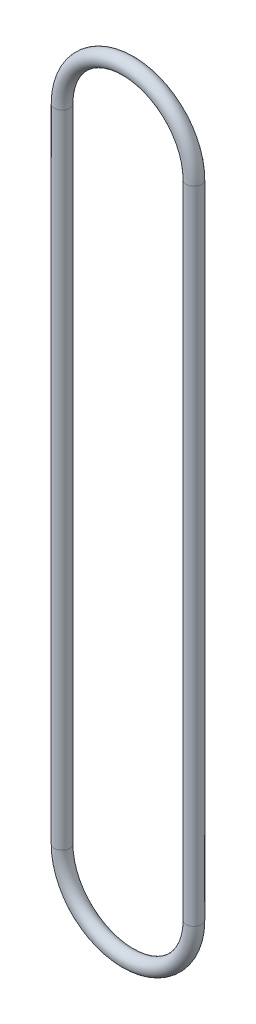
ISO-10303-21;
HEADER;
FILE_DESCRIPTION(('STEP AP214'),'2;1');
FILE_NAME('part.step','',(''),(''),'','','');
FILE_SCHEMA(('AUTOMOTIVE_DESIGN { 1 0 10303 214 1 1 1 1 }'));
ENDSEC;
DATA;
#1=APPLICATION_CONTEXT('core data for automotive mechanical design processes');
#2=APPLICATION_PROTOCOL_DEFINITION('international standard','automotive_design',2000,#1);
#3=PRODUCT_CONTEXT('',#1,'mechanical');
#4=PRODUCT('Part','Part','',(#3));
#5=PRODUCT_RELATED_PRODUCT_CATEGORY('part','',(#4));
#6=PRODUCT_DEFINITION_FORMATION('','',#4);
#7=PRODUCT_DEFINITION_CONTEXT('part definition',#1,'design');
#8=PRODUCT_DEFINITION('design','',#6,#7);
#9=PRODUCT_DEFINITION_SHAPE('','',#8);
#10=(LENGTH_UNIT() NAMED_UNIT(*) SI_UNIT(.MILLI.,.METRE.));
#11=(NAMED_UNIT(*) PLANE_ANGLE_UNIT() SI_UNIT($,.RADIAN.));
#12=(NAMED_UNIT(*) SI_UNIT($,.STERADIAN.) SOLID_ANGLE_UNIT());
#13=UNCERTAINTY_MEASURE_WITH_UNIT(LENGTH_MEASURE(1.E-05),#10,'distance_accuracy_value','');
#14=(GEOMETRIC_REPRESENTATION_CONTEXT(3) GLOBAL_UNCERTAINTY_ASSIGNED_CONTEXT((#13)) GLOBAL_UNIT_ASSIGNED_CONTEXT((#10,
#11,#12)) REPRESENTATION_CONTEXT('',''));
#15=CARTESIAN_POINT('',(0.,0.,0.));
#16=DIRECTION('',(0.,0.,1.));
#17=DIRECTION('',(1.,0.,0.));
#18=AXIS2_PLACEMENT_3D('',#15,#16,#17);
#19=CARTESIAN_POINT('',(21.5000000000001,-104.51425,0.));
#20=DIRECTION('',(0.,1.,0.));
#21=DIRECTION('',(-1.,0.,0.));
#22=AXIS2_PLACEMENT_3D('',#19,#20,#21);
#23=CYLINDRICAL_SURFACE('',#22,2.5);
#24=CARTESIAN_POINT('',(21.5,-104.51425,0.));
#25=DIRECTION('',(0.,1.,0.));
#26=DIRECTION('',(1.,0.,0.));
#27=AXIS2_PLACEMENT_3D('',#24,#25,#26);
#28=CIRCLE('',#27,2.5);
#29=CARTESIAN_POINT('',(24.,-104.51425,0.));
#30=VERTEX_POINT('',#29);
#31=EDGE_CURVE('E48',#30,#30,#28,.F.);
#32=ORIENTED_EDGE('',*,*,#31,.F.);
#33=EDGE_LOOP('',(#32));
#34=FACE_BOUND('',#33,.T.);
#35=CARTESIAN_POINT('',(21.5,104.51425,0.));
#36=DIRECTION('',(0.,1.,0.));
#37=DIRECTION('',(1.,0.,0.));
#38=AXIS2_PLACEMENT_3D('',#35,#36,#37);
#39=CIRCLE('',#38,2.5);
#40=CARTESIAN_POINT('',(24.,104.51425,0.));
#41=VERTEX_POINT('',#40);
#42=EDGE_CURVE('E26',#41,#41,#39,.T.);
#43=ORIENTED_EDGE('',*,*,#42,.F.);
#44=EDGE_LOOP('',(#43));
#45=FACE_BOUND('',#44,.T.);
#46=ADVANCED_FACE('F14',(#34,#45),#23,.T.);
#47=CARTESIAN_POINT('',(0.,-104.51425,0.));
#48=DIRECTION('',(0.,0.,1.));
#49=DIRECTION('',(1.,0.,0.));
#50=AXIS2_PLACEMENT_3D('',#47,#48,#49);
#51=TOROIDAL_SURFACE('',#50,21.5,2.5);
#52=CARTESIAN_POINT('',(-21.5,-104.51425,0.));
#53=DIRECTION('',(0.,-1.,0.));
#54=DIRECTION('',(1.,0.,0.));
#55=AXIS2_PLACEMENT_3D('',#52,#53,#54);
#56=CIRCLE('',#55,2.5);
#57=CARTESIAN_POINT('',(-19.,-104.51425,0.));
#58=VERTEX_POINT('',#57);
#59=EDGE_CURVE('E21',#58,#58,#56,.F.);
#60=ORIENTED_EDGE('',*,*,#59,.F.);
#61=EDGE_LOOP('',(#60));
#62=FACE_BOUND('',#61,.T.);
#63=ORIENTED_EDGE('',*,*,#31,.T.);
#64=EDGE_LOOP('',(#63));
#65=FACE_BOUND('',#64,.T.);
#66=ADVANCED_FACE('F41',(#62,#65),#51,.T.);
#67=CARTESIAN_POINT('',(0.,104.51425,0.));
#68=DIRECTION('',(0.,0.,1.));
#69=DIRECTION('',(1.,0.,0.));
#70=AXIS2_PLACEMENT_3D('',#67,#68,#69);
#71=TOROIDAL_SURFACE('',#70,21.5,2.5);
#72=ORIENTED_EDGE('',*,*,#42,.T.);
#73=EDGE_LOOP('',(#72));
#74=FACE_BOUND('',#73,.T.);
#75=CARTESIAN_POINT('',(-21.5,104.51425,0.));
#76=DIRECTION('',(0.,-1.,0.));
#77=DIRECTION('',(1.,0.,0.));
#78=AXIS2_PLACEMENT_3D('',#75,#76,#77);
#79=CIRCLE('',#78,2.5);
#80=CARTESIAN_POINT('',(-19.,104.51425,0.));
#81=VERTEX_POINT('',#80);
#82=EDGE_CURVE('E9',#81,#81,#79,.T.);
#83=ORIENTED_EDGE('',*,*,#82,.F.);
#84=EDGE_LOOP('',(#83));
#85=FACE_BOUND('',#84,.T.);
#86=ADVANCED_FACE('F37',(#74,#85),#71,.T.);
#87=CARTESIAN_POINT('',(-21.5,104.51425,0.));
#88=DIRECTION('',(0.,-1.,0.));
#89=DIRECTION('',(1.,0.,0.));
#90=AXIS2_PLACEMENT_3D('',#87,#88,#89);
#91=CYLINDRICAL_SURFACE('',#90,2.5);
#92=ORIENTED_EDGE('',*,*,#82,.T.);
#93=EDGE_LOOP('',(#92));
#94=FACE_BOUND('',#93,.T.);
#95=ORIENTED_EDGE('',*,*,#59,.T.);
#96=EDGE_LOOP('',(#95));
#97=FACE_BOUND('',#96,.T.);
#98=ADVANCED_FACE('F40',(#94,#97),#91,.T.);
#99=CLOSED_SHELL('',(#46,#66,#86,#98));
#100=MANIFOLD_SOLID_BREP('B1',#99);
#101=ADVANCED_BREP_SHAPE_REPRESENTATION('',(#18,#100),#14);
#102=SHAPE_DEFINITION_REPRESENTATION(#9,#101);
ENDSEC;
END-ISO-10303-21;
